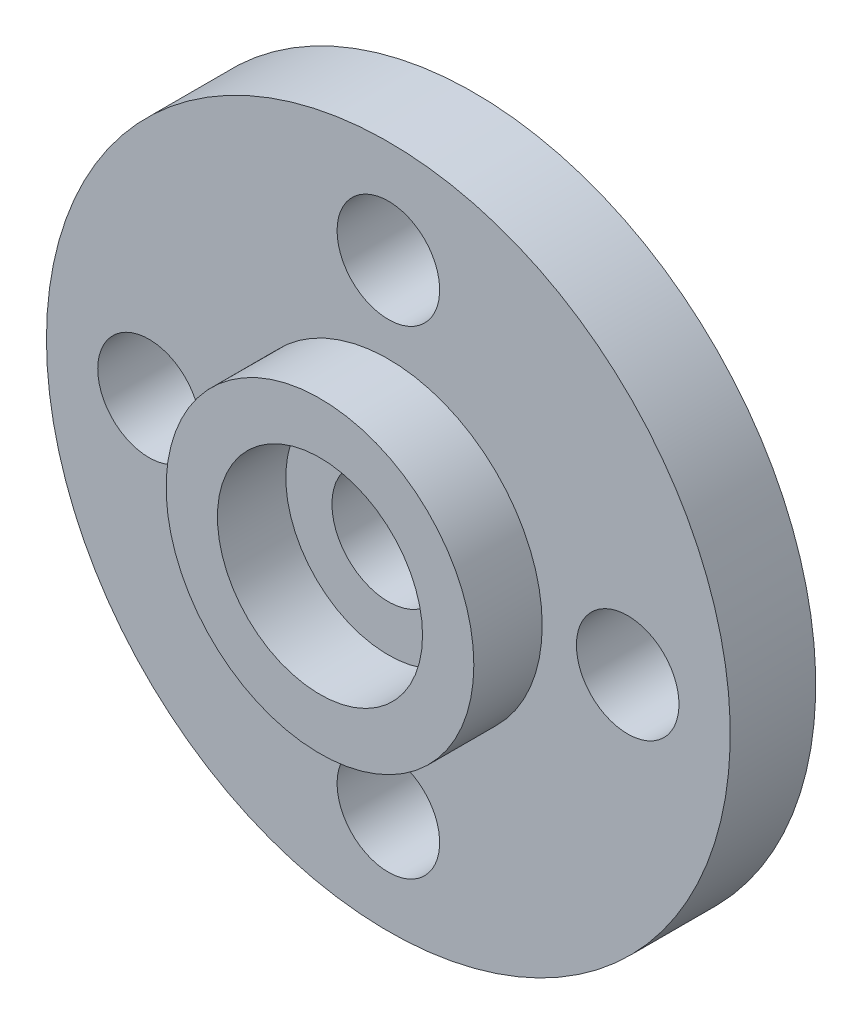
ISO-10303-21;
HEADER;
FILE_DESCRIPTION(('STEP AP214'),'2;1');
FILE_NAME('part.step','',(''),(''),'','','');
FILE_SCHEMA(('AUTOMOTIVE_DESIGN { 1 0 10303 214 1 1 1 1 }'));
ENDSEC;
DATA;
#1=APPLICATION_CONTEXT('core data for automotive mechanical design processes');
#2=APPLICATION_PROTOCOL_DEFINITION('international standard','automotive_design',2000,#1);
#3=PRODUCT_CONTEXT('',#1,'mechanical');
#4=PRODUCT('Part','Part','',(#3));
#5=PRODUCT_RELATED_PRODUCT_CATEGORY('part','',(#4));
#6=PRODUCT_DEFINITION_FORMATION('','',#4);
#7=PRODUCT_DEFINITION_CONTEXT('part definition',#1,'design');
#8=PRODUCT_DEFINITION('design','',#6,#7);
#9=PRODUCT_DEFINITION_SHAPE('','',#8);
#10=(LENGTH_UNIT() NAMED_UNIT(*) SI_UNIT(.MILLI.,.METRE.));
#11=(NAMED_UNIT(*) PLANE_ANGLE_UNIT() SI_UNIT($,.RADIAN.));
#12=(NAMED_UNIT(*) SI_UNIT($,.STERADIAN.) SOLID_ANGLE_UNIT());
#13=UNCERTAINTY_MEASURE_WITH_UNIT(LENGTH_MEASURE(1.E-05),#10,'distance_accuracy_value','');
#14=(GEOMETRIC_REPRESENTATION_CONTEXT(3) GLOBAL_UNCERTAINTY_ASSIGNED_CONTEXT((#13)) GLOBAL_UNIT_ASSIGNED_CONTEXT((#10,
#11,#12)) REPRESENTATION_CONTEXT('',''));
#15=CARTESIAN_POINT('',(0.,0.,0.));
#16=DIRECTION('',(0.,0.,1.));
#17=DIRECTION('',(1.,0.,0.));
#18=AXIS2_PLACEMENT_3D('',#15,#16,#17);
#19=CARTESIAN_POINT('',(0.,0.,2.));
#20=DIRECTION('',(0.,0.,1.));
#21=DIRECTION('',(1.,0.,0.));
#22=AXIS2_PLACEMENT_3D('',#19,#20,#21);
#23=PLANE('',#22);
#24=CARTESIAN_POINT('',(0.,0.,2.));
#25=DIRECTION('',(0.,0.,1.));
#26=DIRECTION('',(1.,0.,0.));
#27=AXIS2_PLACEMENT_3D('',#24,#25,#26);
#28=CIRCLE('',#27,4.5);
#29=CARTESIAN_POINT('',(4.5,0.,2.));
#30=VERTEX_POINT('',#29);
#31=EDGE_CURVE('E10',#30,#30,#28,.T.);
#32=ORIENTED_EDGE('',*,*,#31,.T.);
#33=EDGE_LOOP('',(#32));
#34=FACE_BOUND('',#33,.T.);
#35=CARTESIAN_POINT('',(0.,0.,2.));
#36=DIRECTION('',(0.,0.,1.));
#37=DIRECTION('',(1.,0.,0.));
#38=AXIS2_PLACEMENT_3D('',#35,#36,#37);
#39=CIRCLE('',#38,3.);
#40=CARTESIAN_POINT('',(3.,0.,2.));
#41=VERTEX_POINT('',#40);
#42=EDGE_CURVE('E39',#41,#41,#39,.T.);
#43=ORIENTED_EDGE('',*,*,#42,.F.);
#44=EDGE_LOOP('',(#43));
#45=FACE_BOUND('',#44,.T.);
#46=ADVANCED_FACE('F31',(#34,#45),#23,.T.);
#47=CARTESIAN_POINT('',(0.,0.,2.));
#48=DIRECTION('',(0.,0.,-1.));
#49=DIRECTION('',(-1.,0.,0.));
#50=AXIS2_PLACEMENT_3D('',#47,#48,#49);
#51=CYLINDRICAL_SURFACE('',#50,4.5);
#52=ORIENTED_EDGE('',*,*,#31,.F.);
#53=EDGE_LOOP('',(#52));
#54=FACE_BOUND('',#53,.T.);
#55=CARTESIAN_POINT('',(0.,0.,0.));
#56=DIRECTION('',(0.,0.,1.));
#57=DIRECTION('',(1.,0.,0.));
#58=AXIS2_PLACEMENT_3D('',#55,#56,#57);
#59=CIRCLE('',#58,4.5);
#60=CARTESIAN_POINT('',(4.5,0.,0.));
#61=VERTEX_POINT('',#60);
#62=EDGE_CURVE('E35',#61,#61,#59,.T.);
#63=ORIENTED_EDGE('',*,*,#62,.T.);
#64=EDGE_LOOP('',(#63));
#65=FACE_BOUND('',#64,.T.);
#66=ADVANCED_FACE('F33',(#54,#65),#51,.T.);
#67=CARTESIAN_POINT('',(0.,0.,2.));
#68=DIRECTION('',(0.,0.,-1.));
#69=DIRECTION('',(-1.,0.,0.));
#70=AXIS2_PLACEMENT_3D('',#67,#68,#69);
#71=CYLINDRICAL_SURFACE('',#70,3.);
#72=ORIENTED_EDGE('',*,*,#42,.T.);
#73=EDGE_LOOP('',(#72));
#74=FACE_BOUND('',#73,.T.);
#75=CARTESIAN_POINT('',(0.,0.,0.));
#76=DIRECTION('',(0.,0.,1.));
#77=DIRECTION('',(1.,0.,0.));
#78=AXIS2_PLACEMENT_3D('',#75,#76,#77);
#79=CIRCLE('',#78,3.);
#80=CARTESIAN_POINT('',(3.,0.,0.));
#81=VERTEX_POINT('',#80);
#82=EDGE_CURVE('E43',#81,#81,#79,.T.);
#83=ORIENTED_EDGE('',*,*,#82,.F.);
#84=EDGE_LOOP('',(#83));
#85=FACE_BOUND('',#84,.T.);
#86=ADVANCED_FACE('F120',(#74,#85),#71,.F.);
#87=CARTESIAN_POINT('',(0.,0.,0.));
#88=DIRECTION('',(0.,0.,-1.));
#89=DIRECTION('',(-1.,0.,0.));
#90=AXIS2_PLACEMENT_3D('',#87,#88,#89);
#91=PLANE('',#90);
#92=CARTESIAN_POINT('',(0.,0.,0.));
#93=DIRECTION('',(0.,0.,-1.));
#94=DIRECTION('',(-1.,0.,0.));
#95=AXIS2_PLACEMENT_3D('',#92,#93,#94);
#96=CIRCLE('',#95,1.65);
#97=CARTESIAN_POINT('',(-1.65,0.,0.));
#98=VERTEX_POINT('',#97);
#99=EDGE_CURVE('E55',#98,#98,#96,.T.);
#100=ORIENTED_EDGE('',*,*,#99,.T.);
#101=EDGE_LOOP('',(#100));
#102=FACE_BOUND('',#101,.T.);
#103=ORIENTED_EDGE('',*,*,#82,.T.);
#104=EDGE_LOOP('',(#103));
#105=FACE_BOUND('',#104,.T.);
#106=ADVANCED_FACE('F98',(#102,#105),#91,.F.);
#107=CARTESIAN_POINT('',(0.,0.,-2.5));
#108=DIRECTION('',(0.,0.,-1.));
#109=DIRECTION('',(-1.,0.,0.));
#110=AXIS2_PLACEMENT_3D('',#107,#108,#109);
#111=PLANE('',#110);
#112=CARTESIAN_POINT('',(-7.,0.,-2.5));
#113=DIRECTION('',(0.,0.,-1.));
#114=DIRECTION('',(-1.,0.,0.));
#115=AXIS2_PLACEMENT_3D('',#112,#113,#114);
#116=CIRCLE('',#115,1.5);
#117=CARTESIAN_POINT('',(-8.5,0.,-2.5));
#118=VERTEX_POINT('',#117);
#119=EDGE_CURVE('E79',#118,#118,#116,.T.);
#120=ORIENTED_EDGE('',*,*,#119,.F.);
#121=EDGE_LOOP('',(#120));
#122=FACE_BOUND('',#121,.T.);
#123=CARTESIAN_POINT('',(0.,-7.,-2.5));
#124=DIRECTION('',(0.,0.,-1.));
#125=DIRECTION('',(-1.,0.,0.));
#126=AXIS2_PLACEMENT_3D('',#123,#124,#125);
#127=CIRCLE('',#126,1.5);
#128=CARTESIAN_POINT('',(-1.49999999999998,-7.,-2.5));
#129=VERTEX_POINT('',#128);
#130=EDGE_CURVE('E73',#129,#129,#127,.T.);
#131=ORIENTED_EDGE('',*,*,#130,.F.);
#132=EDGE_LOOP('',(#131));
#133=FACE_BOUND('',#132,.T.);
#134=CARTESIAN_POINT('',(7.,0.,-2.5));
#135=DIRECTION('',(0.,0.,-1.));
#136=DIRECTION('',(-1.,0.,0.));
#137=AXIS2_PLACEMENT_3D('',#134,#135,#136);
#138=CIRCLE('',#137,1.5);
#139=CARTESIAN_POINT('',(5.5,0.,-2.5));
#140=VERTEX_POINT('',#139);
#141=EDGE_CURVE('E67',#140,#140,#138,.T.);
#142=ORIENTED_EDGE('',*,*,#141,.F.);
#143=EDGE_LOOP('',(#142));
#144=FACE_BOUND('',#143,.T.);
#145=CARTESIAN_POINT('',(0.,7.,-2.5));
#146=DIRECTION('',(0.,0.,-1.));
#147=DIRECTION('',(-1.,0.,0.));
#148=AXIS2_PLACEMENT_3D('',#145,#146,#147);
#149=CIRCLE('',#148,1.5);
#150=CARTESIAN_POINT('',(-1.50000000000007,7.,-2.5));
#151=VERTEX_POINT('',#150);
#152=EDGE_CURVE('E61',#151,#151,#149,.T.);
#153=ORIENTED_EDGE('',*,*,#152,.F.);
#154=EDGE_LOOP('',(#153));
#155=FACE_BOUND('',#154,.T.);
#156=CARTESIAN_POINT('',(0.,0.,-2.5));
#157=DIRECTION('',(0.,0.,-1.));
#158=DIRECTION('',(-1.,0.,0.));
#159=AXIS2_PLACEMENT_3D('',#156,#157,#158);
#160=CIRCLE('',#159,10.);
#161=CARTESIAN_POINT('',(-10.,0.,-2.5));
#162=VERTEX_POINT('',#161);
#163=EDGE_CURVE('E51',#162,#162,#160,.T.);
#164=ORIENTED_EDGE('',*,*,#163,.T.);
#165=EDGE_LOOP('',(#164));
#166=FACE_BOUND('',#165,.T.);
#167=CARTESIAN_POINT('',(0.,0.,-2.5));
#168=DIRECTION('',(0.,0.,-1.));
#169=DIRECTION('',(-1.,0.,0.));
#170=AXIS2_PLACEMENT_3D('',#167,#168,#169);
#171=CIRCLE('',#170,1.65);
#172=CARTESIAN_POINT('',(-1.65,0.,-2.5));
#173=VERTEX_POINT('',#172);
#174=EDGE_CURVE('E52',#173,#173,#171,.T.);
#175=ORIENTED_EDGE('',*,*,#174,.F.);
#176=EDGE_LOOP('',(#175));
#177=FACE_BOUND('',#176,.T.);
#178=ADVANCED_FACE('F95',(#122,#133,#144,#155,#166,#177),#111,.T.);
#179=CARTESIAN_POINT('',(-7.,0.,0.));
#180=DIRECTION('',(0.,0.,-1.));
#181=DIRECTION('',(-1.,0.,0.));
#182=AXIS2_PLACEMENT_3D('',#179,#180,#181);
#183=CIRCLE('',#182,1.5);
#184=CARTESIAN_POINT('',(-8.5,0.,0.));
#185=VERTEX_POINT('',#184);
#186=EDGE_CURVE('E58',#185,#185,#183,.T.);
#187=ORIENTED_EDGE('',*,*,#186,.T.);
#188=EDGE_LOOP('',(#187));
#189=FACE_BOUND('',#188,.T.);
#190=CARTESIAN_POINT('',(0.,-7.,0.));
#191=DIRECTION('',(0.,0.,-1.));
#192=DIRECTION('',(-1.,0.,0.));
#193=AXIS2_PLACEMENT_3D('',#190,#191,#192);
#194=CIRCLE('',#193,1.5);
#195=CARTESIAN_POINT('',(-1.49999999999998,-7.,0.));
#196=VERTEX_POINT('',#195);
#197=EDGE_CURVE('E76',#196,#196,#194,.T.);
#198=ORIENTED_EDGE('',*,*,#197,.T.);
#199=EDGE_LOOP('',(#198));
#200=FACE_BOUND('',#199,.T.);
#201=CARTESIAN_POINT('',(7.,0.,0.));
#202=DIRECTION('',(0.,0.,-1.));
#203=DIRECTION('',(-1.,0.,0.));
#204=AXIS2_PLACEMENT_3D('',#201,#202,#203);
#205=CIRCLE('',#204,1.5);
#206=CARTESIAN_POINT('',(5.5,0.,0.));
#207=VERTEX_POINT('',#206);
#208=EDGE_CURVE('E70',#207,#207,#205,.T.);
#209=ORIENTED_EDGE('',*,*,#208,.T.);
#210=EDGE_LOOP('',(#209));
#211=FACE_BOUND('',#210,.T.);
#212=CARTESIAN_POINT('',(0.,7.,0.));
#213=DIRECTION('',(0.,0.,-1.));
#214=DIRECTION('',(-1.,0.,0.));
#215=AXIS2_PLACEMENT_3D('',#212,#213,#214);
#216=CIRCLE('',#215,1.5);
#217=CARTESIAN_POINT('',(-1.50000000000007,7.,0.));
#218=VERTEX_POINT('',#217);
#219=EDGE_CURVE('E64',#218,#218,#216,.T.);
#220=ORIENTED_EDGE('',*,*,#219,.T.);
#221=EDGE_LOOP('',(#220));
#222=FACE_BOUND('',#221,.T.);
#223=ORIENTED_EDGE('',*,*,#62,.F.);
#224=EDGE_LOOP('',(#223));
#225=FACE_BOUND('',#224,.T.);
#226=CARTESIAN_POINT('',(0.,0.,0.));
#227=DIRECTION('',(0.,0.,-1.));
#228=DIRECTION('',(-1.,0.,0.));
#229=AXIS2_PLACEMENT_3D('',#226,#227,#228);
#230=CIRCLE('',#229,10.);
#231=CARTESIAN_POINT('',(-10.,0.,0.));
#232=VERTEX_POINT('',#231);
#233=EDGE_CURVE('E48',#232,#232,#230,.T.);
#234=ORIENTED_EDGE('',*,*,#233,.F.);
#235=EDGE_LOOP('',(#234));
#236=FACE_BOUND('',#235,.T.);
#237=ADVANCED_FACE('F85',(#189,#200,#211,#222,#225,#236),#91,.F.);
#238=CARTESIAN_POINT('',(0.,0.,-2.5));
#239=DIRECTION('',(0.,0.,1.));
#240=DIRECTION('',(1.,0.,0.));
#241=AXIS2_PLACEMENT_3D('',#238,#239,#240);
#242=CYLINDRICAL_SURFACE('',#241,10.);
#243=ORIENTED_EDGE('',*,*,#163,.F.);
#244=EDGE_LOOP('',(#243));
#245=FACE_BOUND('',#244,.T.);
#246=ORIENTED_EDGE('',*,*,#233,.T.);
#247=EDGE_LOOP('',(#246));
#248=FACE_BOUND('',#247,.T.);
#249=ADVANCED_FACE('F114',(#245,#248),#242,.T.);
#250=CARTESIAN_POINT('',(0.,0.,-2.5));
#251=DIRECTION('',(0.,0.,1.));
#252=DIRECTION('',(1.,0.,0.));
#253=AXIS2_PLACEMENT_3D('',#250,#251,#252);
#254=CYLINDRICAL_SURFACE('',#253,1.65);
#255=ORIENTED_EDGE('',*,*,#174,.T.);
#256=EDGE_LOOP('',(#255));
#257=FACE_BOUND('',#256,.T.);
#258=ORIENTED_EDGE('',*,*,#99,.F.);
#259=EDGE_LOOP('',(#258));
#260=FACE_BOUND('',#259,.T.);
#261=ADVANCED_FACE('F110',(#257,#260),#254,.F.);
#262=CARTESIAN_POINT('',(0.,7.,0.));
#263=DIRECTION('',(0.,0.,-1.));
#264=DIRECTION('',(-1.,0.,0.));
#265=AXIS2_PLACEMENT_3D('',#262,#263,#264);
#266=CYLINDRICAL_SURFACE('',#265,1.5);
#267=ORIENTED_EDGE('',*,*,#219,.F.);
#268=EDGE_LOOP('',(#267));
#269=FACE_BOUND('',#268,.T.);
#270=ORIENTED_EDGE('',*,*,#152,.T.);
#271=EDGE_LOOP('',(#270));
#272=FACE_BOUND('',#271,.T.);
#273=ADVANCED_FACE('F113',(#269,#272),#266,.F.);
#274=CARTESIAN_POINT('',(7.,0.,0.));
#275=DIRECTION('',(0.,0.,-1.));
#276=DIRECTION('',(-1.,0.,0.));
#277=AXIS2_PLACEMENT_3D('',#274,#275,#276);
#278=CYLINDRICAL_SURFACE('',#277,1.5);
#279=ORIENTED_EDGE('',*,*,#208,.F.);
#280=EDGE_LOOP('',(#279));
#281=FACE_BOUND('',#280,.T.);
#282=ORIENTED_EDGE('',*,*,#141,.T.);
#283=EDGE_LOOP('',(#282));
#284=FACE_BOUND('',#283,.T.);
#285=ADVANCED_FACE('F187',(#281,#284),#278,.F.);
#286=CARTESIAN_POINT('',(0.,-7.,0.));
#287=DIRECTION('',(0.,0.,-1.));
#288=DIRECTION('',(-1.,0.,0.));
#289=AXIS2_PLACEMENT_3D('',#286,#287,#288);
#290=CYLINDRICAL_SURFACE('',#289,1.5);
#291=ORIENTED_EDGE('',*,*,#197,.F.);
#292=EDGE_LOOP('',(#291));
#293=FACE_BOUND('',#292,.T.);
#294=ORIENTED_EDGE('',*,*,#130,.T.);
#295=EDGE_LOOP('',(#294));
#296=FACE_BOUND('',#295,.T.);
#297=ADVANCED_FACE('F91',(#293,#296),#290,.F.);
#298=CARTESIAN_POINT('',(-7.,0.,0.));
#299=DIRECTION('',(0.,0.,-1.));
#300=DIRECTION('',(-1.,0.,0.));
#301=AXIS2_PLACEMENT_3D('',#298,#299,#300);
#302=CYLINDRICAL_SURFACE('',#301,1.5);
#303=ORIENTED_EDGE('',*,*,#186,.F.);
#304=EDGE_LOOP('',(#303));
#305=FACE_BOUND('',#304,.T.);
#306=ORIENTED_EDGE('',*,*,#119,.T.);
#307=EDGE_LOOP('',(#306));
#308=FACE_BOUND('',#307,.T.);
#309=ADVANCED_FACE('F88',(#305,#308),#302,.F.);
#310=CLOSED_SHELL('',(#46,#66,#86,#106,#178,#237,#249,#261,#273,#285,#297,#309));
#311=MANIFOLD_SOLID_BREP('B2',#310);
#312=ADVANCED_BREP_SHAPE_REPRESENTATION('',(#18,#311),#14);
#313=SHAPE_DEFINITION_REPRESENTATION(#9,#312);
ENDSEC;
END-ISO-10303-21;
